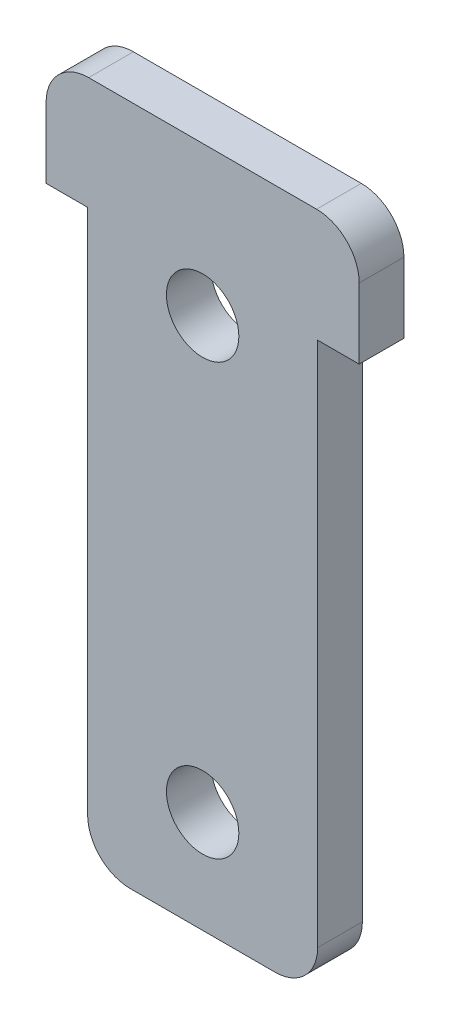
ISO-10303-21;
HEADER;
FILE_DESCRIPTION(('STEP AP214'),'2;1');
FILE_NAME('part.step','',(''),(''),'','','');
FILE_SCHEMA(('AUTOMOTIVE_DESIGN { 1 0 10303 214 1 1 1 1 }'));
ENDSEC;
DATA;
#1=APPLICATION_CONTEXT('core data for automotive mechanical design processes');
#2=APPLICATION_PROTOCOL_DEFINITION('international standard','automotive_design',2000,#1);
#3=PRODUCT_CONTEXT('',#1,'mechanical');
#4=PRODUCT('Part','Part','',(#3));
#5=PRODUCT_RELATED_PRODUCT_CATEGORY('part','',(#4));
#6=PRODUCT_DEFINITION_FORMATION('','',#4);
#7=PRODUCT_DEFINITION_CONTEXT('part definition',#1,'design');
#8=PRODUCT_DEFINITION('design','',#6,#7);
#9=PRODUCT_DEFINITION_SHAPE('','',#8);
#10=(LENGTH_UNIT() NAMED_UNIT(*) SI_UNIT(.MILLI.,.METRE.));
#11=(NAMED_UNIT(*) PLANE_ANGLE_UNIT() SI_UNIT($,.RADIAN.));
#12=(NAMED_UNIT(*) SI_UNIT($,.STERADIAN.) SOLID_ANGLE_UNIT());
#13=UNCERTAINTY_MEASURE_WITH_UNIT(LENGTH_MEASURE(1.E-05),#10,'distance_accuracy_value','');
#14=(GEOMETRIC_REPRESENTATION_CONTEXT(3) GLOBAL_UNCERTAINTY_ASSIGNED_CONTEXT((#13)) GLOBAL_UNIT_ASSIGNED_CONTEXT((#10,
#11,#12)) REPRESENTATION_CONTEXT('',''));
#15=CARTESIAN_POINT('',(0.,0.,0.));
#16=DIRECTION('',(0.,0.,1.));
#17=DIRECTION('',(1.,0.,0.));
#18=AXIS2_PLACEMENT_3D('',#15,#16,#17);
#19=CARTESIAN_POINT('',(10.8,0.,2.1));
#20=DIRECTION('',(-1.,0.,0.));
#21=DIRECTION('',(0.,-1.,0.));
#22=AXIS2_PLACEMENT_3D('',#19,#20,#21);
#23=PLANE('',#22);
#24=DIRECTION('',(0.,1.,0.));
#25=VECTOR('',#24,1.);
#26=CARTESIAN_POINT('',(10.8,0.,0.));
#27=LINE('',#26,#25);
#28=CARTESIAN_POINT('',(10.8,2.00000000000001,0.));
#29=VERTEX_POINT('',#28);
#30=CARTESIAN_POINT('',(10.8,26.7,0.));
#31=VERTEX_POINT('',#30);
#32=EDGE_CURVE('E177',#29,#31,#27,.T.);
#33=ORIENTED_EDGE('',*,*,#32,.T.);
#34=DIRECTION('',(0.,0.,-1.));
#35=VECTOR('',#34,1.);
#36=CARTESIAN_POINT('',(10.8,26.7,2.1));
#37=LINE('',#36,#35);
#38=CARTESIAN_POINT('',(10.8,26.7,2.1));
#39=VERTEX_POINT('',#38);
#40=EDGE_CURVE('E11',#39,#31,#37,.T.);
#41=ORIENTED_EDGE('',*,*,#40,.F.);
#42=DIRECTION('',(0.,1.,0.));
#43=VECTOR('',#42,1.);
#44=CARTESIAN_POINT('',(10.8,0.,2.1));
#45=LINE('',#44,#43);
#46=CARTESIAN_POINT('',(10.8,2.00000000000001,2.1));
#47=VERTEX_POINT('',#46);
#48=EDGE_CURVE('E223',#47,#39,#45,.T.);
#49=ORIENTED_EDGE('',*,*,#48,.F.);
#50=DIRECTION('',(0.,0.,-1.));
#51=VECTOR('',#50,1.);
#52=CARTESIAN_POINT('',(10.8,2.00000000000001,2.1));
#53=LINE('',#52,#51);
#54=EDGE_CURVE('E176',#47,#29,#53,.T.);
#55=ORIENTED_EDGE('',*,*,#54,.T.);
#56=EDGE_LOOP('',(#33,#41,#49,#55));
#57=FACE_BOUND('',#56,.T.);
#58=ADVANCED_FACE('F41',(#57),#23,.F.);
#59=CARTESIAN_POINT('',(0.,26.7,2.1));
#60=DIRECTION('',(0.,1.,0.));
#61=DIRECTION('',(-1.,0.,0.));
#62=AXIS2_PLACEMENT_3D('',#59,#60,#61);
#63=PLANE('',#62);
#64=DIRECTION('',(1.,0.,0.));
#65=VECTOR('',#64,1.);
#66=CARTESIAN_POINT('',(0.,26.7,0.));
#67=LINE('',#66,#65);
#68=CARTESIAN_POINT('',(12.75,26.7,0.));
#69=VERTEX_POINT('',#68);
#70=EDGE_CURVE('E181',#31,#69,#67,.T.);
#71=ORIENTED_EDGE('',*,*,#70,.T.);
#72=DIRECTION('',(0.,0.,-1.));
#73=VECTOR('',#72,1.);
#74=CARTESIAN_POINT('',(12.75,26.7,2.1));
#75=LINE('',#74,#73);
#76=CARTESIAN_POINT('',(12.75,26.7,2.1));
#77=VERTEX_POINT('',#76);
#78=EDGE_CURVE('E50',#77,#69,#75,.T.);
#79=ORIENTED_EDGE('',*,*,#78,.F.);
#80=DIRECTION('',(1.,0.,0.));
#81=VECTOR('',#80,1.);
#82=CARTESIAN_POINT('',(0.,26.7,2.1));
#83=LINE('',#82,#81);
#84=EDGE_CURVE('E112',#39,#77,#83,.T.);
#85=ORIENTED_EDGE('',*,*,#84,.F.);
#86=ORIENTED_EDGE('',*,*,#40,.T.);
#87=EDGE_LOOP('',(#71,#79,#85,#86));
#88=FACE_BOUND('',#87,.T.);
#89=ADVANCED_FACE('F294',(#88),#63,.F.);
#90=CARTESIAN_POINT('',(12.75,0.,2.1));
#91=DIRECTION('',(-1.,0.,0.));
#92=DIRECTION('',(0.,-1.,0.));
#93=AXIS2_PLACEMENT_3D('',#90,#91,#92);
#94=PLANE('',#93);
#95=DIRECTION('',(0.,1.,0.));
#96=VECTOR('',#95,1.);
#97=CARTESIAN_POINT('',(12.75,0.,0.));
#98=LINE('',#97,#96);
#99=CARTESIAN_POINT('',(12.75,30.,0.));
#100=VERTEX_POINT('',#99);
#101=EDGE_CURVE('E184',#69,#100,#98,.T.);
#102=ORIENTED_EDGE('',*,*,#101,.T.);
#103=DIRECTION('',(0.,0.,-1.));
#104=VECTOR('',#103,1.);
#105=CARTESIAN_POINT('',(12.75,30.,2.1));
#106=LINE('',#105,#104);
#107=CARTESIAN_POINT('',(12.75,30.,2.1));
#108=VERTEX_POINT('',#107);
#109=EDGE_CURVE('E245',#108,#100,#106,.T.);
#110=ORIENTED_EDGE('',*,*,#109,.F.);
#111=DIRECTION('',(0.,1.,0.));
#112=VECTOR('',#111,1.);
#113=CARTESIAN_POINT('',(12.75,0.,2.1));
#114=LINE('',#113,#112);
#115=EDGE_CURVE('E254',#77,#108,#114,.T.);
#116=ORIENTED_EDGE('',*,*,#115,.F.);
#117=ORIENTED_EDGE('',*,*,#78,.T.);
#118=EDGE_LOOP('',(#102,#110,#116,#117));
#119=FACE_BOUND('',#118,.T.);
#120=ADVANCED_FACE('F252',(#119),#94,.F.);
#121=CARTESIAN_POINT('',(10.75,30.,2.1));
#122=DIRECTION('',(0.,0.,-1.));
#123=DIRECTION('',(-1.,0.,0.));
#124=AXIS2_PLACEMENT_3D('',#121,#122,#123);
#125=CYLINDRICAL_SURFACE('',#124,2.);
#126=CARTESIAN_POINT('',(10.75,30.,0.));
#127=DIRECTION('',(0.,0.,1.));
#128=DIRECTION('',(1.,0.,0.));
#129=AXIS2_PLACEMENT_3D('',#126,#127,#128);
#130=CIRCLE('',#129,2.);
#131=CARTESIAN_POINT('',(10.75,32.,0.));
#132=VERTEX_POINT('',#131);
#133=EDGE_CURVE('E189',#132,#100,#130,.F.);
#134=ORIENTED_EDGE('',*,*,#133,.F.);
#135=DIRECTION('',(0.,0.,-1.));
#136=VECTOR('',#135,1.);
#137=CARTESIAN_POINT('',(10.75,32.,2.1));
#138=LINE('',#137,#136);
#139=CARTESIAN_POINT('',(10.75,32.,2.1));
#140=VERTEX_POINT('',#139);
#141=EDGE_CURVE('E242',#140,#132,#138,.T.);
#142=ORIENTED_EDGE('',*,*,#141,.F.);
#143=CARTESIAN_POINT('',(10.75,30.,2.1));
#144=DIRECTION('',(0.,0.,1.));
#145=DIRECTION('',(1.,0.,0.));
#146=AXIS2_PLACEMENT_3D('',#143,#144,#145);
#147=CIRCLE('',#146,2.);
#148=EDGE_CURVE('E265',#140,#108,#147,.F.);
#149=ORIENTED_EDGE('',*,*,#148,.T.);
#150=ORIENTED_EDGE('',*,*,#109,.T.);
#151=EDGE_LOOP('',(#134,#142,#149,#150));
#152=FACE_BOUND('',#151,.T.);
#153=ADVANCED_FACE('F262',(#152),#125,.T.);
#154=CARTESIAN_POINT('',(0.,32.,2.1));
#155=DIRECTION('',(0.,1.,0.));
#156=DIRECTION('',(0.,0.,1.));
#157=AXIS2_PLACEMENT_3D('',#154,#155,#156);
#158=PLANE('',#157);
#159=DIRECTION('',(1.,0.,0.));
#160=VECTOR('',#159,1.);
#161=CARTESIAN_POINT('',(0.,32.,0.));
#162=LINE('',#161,#160);
#163=CARTESIAN_POINT('',(0.0500000000000092,32.,0.));
#164=VERTEX_POINT('',#163);
#165=EDGE_CURVE('E193',#164,#132,#162,.T.);
#166=ORIENTED_EDGE('',*,*,#165,.F.);
#167=DIRECTION('',(0.,0.,-1.));
#168=VECTOR('',#167,1.);
#169=CARTESIAN_POINT('',(0.0500000000000092,32.,2.1));
#170=LINE('',#169,#168);
#171=CARTESIAN_POINT('',(0.0500000000000092,32.,2.1));
#172=VERTEX_POINT('',#171);
#173=EDGE_CURVE('E239',#172,#164,#170,.T.);
#174=ORIENTED_EDGE('',*,*,#173,.F.);
#175=DIRECTION('',(1.,0.,0.));
#176=VECTOR('',#175,1.);
#177=CARTESIAN_POINT('',(0.,32.,2.1));
#178=LINE('',#177,#176);
#179=EDGE_CURVE('E269',#172,#140,#178,.T.);
#180=ORIENTED_EDGE('',*,*,#179,.T.);
#181=ORIENTED_EDGE('',*,*,#141,.T.);
#182=EDGE_LOOP('',(#166,#174,#180,#181));
#183=FACE_BOUND('',#182,.T.);
#184=ADVANCED_FACE('F323',(#183),#158,.T.);
#185=CARTESIAN_POINT('',(0.0499999999999945,30.,2.1));
#186=DIRECTION('',(0.,0.,-1.));
#187=DIRECTION('',(-1.,0.,0.));
#188=AXIS2_PLACEMENT_3D('',#185,#186,#187);
#189=CYLINDRICAL_SURFACE('',#188,2.);
#190=CARTESIAN_POINT('',(0.0499999999999945,30.,0.));
#191=DIRECTION('',(0.,0.,1.));
#192=DIRECTION('',(1.,0.,0.));
#193=AXIS2_PLACEMENT_3D('',#190,#191,#192);
#194=CIRCLE('',#193,2.);
#195=CARTESIAN_POINT('',(-1.95000000000001,30.,0.));
#196=VERTEX_POINT('',#195);
#197=EDGE_CURVE('E197',#196,#164,#194,.F.);
#198=ORIENTED_EDGE('',*,*,#197,.F.);
#199=DIRECTION('',(0.,0.,-1.));
#200=VECTOR('',#199,1.);
#201=CARTESIAN_POINT('',(-1.95000000000001,30.,2.1));
#202=LINE('',#201,#200);
#203=CARTESIAN_POINT('',(-1.95000000000001,30.,2.1));
#204=VERTEX_POINT('',#203);
#205=EDGE_CURVE('E236',#204,#196,#202,.T.);
#206=ORIENTED_EDGE('',*,*,#205,.F.);
#207=CARTESIAN_POINT('',(0.0499999999999945,30.,2.1));
#208=DIRECTION('',(0.,0.,1.));
#209=DIRECTION('',(1.,0.,0.));
#210=AXIS2_PLACEMENT_3D('',#207,#208,#209);
#211=CIRCLE('',#210,2.);
#212=EDGE_CURVE('E273',#204,#172,#211,.F.);
#213=ORIENTED_EDGE('',*,*,#212,.T.);
#214=ORIENTED_EDGE('',*,*,#173,.T.);
#215=EDGE_LOOP('',(#198,#206,#213,#214));
#216=FACE_BOUND('',#215,.T.);
#217=ADVANCED_FACE('F313',(#216),#189,.T.);
#218=CARTESIAN_POINT('',(-1.95000000000001,0.,2.1));
#219=DIRECTION('',(-1.,0.,0.));
#220=DIRECTION('',(0.,0.,1.));
#221=AXIS2_PLACEMENT_3D('',#218,#219,#220);
#222=PLANE('',#221);
#223=DIRECTION('',(0.,1.,0.));
#224=VECTOR('',#223,1.);
#225=CARTESIAN_POINT('',(-1.95000000000001,0.,0.));
#226=LINE('',#225,#224);
#227=CARTESIAN_POINT('',(-1.95000000000001,26.7,0.));
#228=VERTEX_POINT('',#227);
#229=EDGE_CURVE('E201',#228,#196,#226,.T.);
#230=ORIENTED_EDGE('',*,*,#229,.F.);
#231=DIRECTION('',(0.,0.,-1.));
#232=VECTOR('',#231,1.);
#233=CARTESIAN_POINT('',(-1.95000000000001,26.7,2.1));
#234=LINE('',#233,#232);
#235=CARTESIAN_POINT('',(-1.95000000000001,26.7,2.1));
#236=VERTEX_POINT('',#235);
#237=EDGE_CURVE('E233',#236,#228,#234,.T.);
#238=ORIENTED_EDGE('',*,*,#237,.F.);
#239=DIRECTION('',(0.,1.,0.));
#240=VECTOR('',#239,1.);
#241=CARTESIAN_POINT('',(-1.95000000000001,0.,2.1));
#242=LINE('',#241,#240);
#243=EDGE_CURVE('E280',#236,#204,#242,.T.);
#244=ORIENTED_EDGE('',*,*,#243,.T.);
#245=ORIENTED_EDGE('',*,*,#205,.T.);
#246=EDGE_LOOP('',(#230,#238,#244,#245));
#247=FACE_BOUND('',#246,.T.);
#248=ADVANCED_FACE('F306',(#247),#222,.T.);
#249=CARTESIAN_POINT('',(0.,26.7,0.));
#250=VERTEX_POINT('',#249);
#251=EDGE_CURVE('E185',#228,#250,#67,.T.);
#252=ORIENTED_EDGE('',*,*,#251,.T.);
#253=DIRECTION('',(0.,0.,-1.));
#254=VECTOR('',#253,1.);
#255=CARTESIAN_POINT('',(0.,26.7,2.1));
#256=LINE('',#255,#254);
#257=CARTESIAN_POINT('',(0.,26.7,2.1));
#258=VERTEX_POINT('',#257);
#259=EDGE_CURVE('E230',#258,#250,#256,.T.);
#260=ORIENTED_EDGE('',*,*,#259,.F.);
#261=EDGE_CURVE('E162',#236,#258,#83,.T.);
#262=ORIENTED_EDGE('',*,*,#261,.F.);
#263=ORIENTED_EDGE('',*,*,#237,.T.);
#264=EDGE_LOOP('',(#252,#260,#262,#263));
#265=FACE_BOUND('',#264,.T.);
#266=ADVANCED_FACE('F297',(#265),#63,.F.);
#267=CARTESIAN_POINT('',(0.,0.,2.1));
#268=DIRECTION('',(-1.,0.,0.));
#269=DIRECTION('',(0.,0.,1.));
#270=AXIS2_PLACEMENT_3D('',#267,#268,#269);
#271=PLANE('',#270);
#272=DIRECTION('',(0.,1.,0.));
#273=VECTOR('',#272,1.);
#274=CARTESIAN_POINT('',(0.,0.,0.));
#275=LINE('',#274,#273);
#276=CARTESIAN_POINT('',(0.,2.00000000000001,0.));
#277=VERTEX_POINT('',#276);
#278=EDGE_CURVE('E205',#277,#250,#275,.T.);
#279=ORIENTED_EDGE('',*,*,#278,.F.);
#280=DIRECTION('',(0.,0.,-1.));
#281=VECTOR('',#280,1.);
#282=CARTESIAN_POINT('',(0.,2.00000000000001,2.1));
#283=LINE('',#282,#281);
#284=CARTESIAN_POINT('',(0.,2.00000000000001,2.1));
#285=VERTEX_POINT('',#284);
#286=EDGE_CURVE('E147',#285,#277,#283,.T.);
#287=ORIENTED_EDGE('',*,*,#286,.F.);
#288=DIRECTION('',(0.,1.,0.));
#289=VECTOR('',#288,1.);
#290=CARTESIAN_POINT('',(0.,0.,2.1));
#291=LINE('',#290,#289);
#292=EDGE_CURVE('E158',#285,#258,#291,.T.);
#293=ORIENTED_EDGE('',*,*,#292,.T.);
#294=ORIENTED_EDGE('',*,*,#259,.T.);
#295=EDGE_LOOP('',(#279,#287,#293,#294));
#296=FACE_BOUND('',#295,.T.);
#297=ADVANCED_FACE('F305',(#296),#271,.T.);
#298=CARTESIAN_POINT('',(2.,2.,2.1));
#299=DIRECTION('',(0.,0.,-1.));
#300=DIRECTION('',(-1.,0.,0.));
#301=AXIS2_PLACEMENT_3D('',#298,#299,#300);
#302=CYLINDRICAL_SURFACE('',#301,2.);
#303=CARTESIAN_POINT('',(2.,2.,0.));
#304=DIRECTION('',(0.,0.,1.));
#305=DIRECTION('',(1.,0.,0.));
#306=AXIS2_PLACEMENT_3D('',#303,#304,#305);
#307=CIRCLE('',#306,2.);
#308=CARTESIAN_POINT('',(2.00000000000001,0.,0.));
#309=VERTEX_POINT('',#308);
#310=EDGE_CURVE('E145',#309,#277,#307,.F.);
#311=ORIENTED_EDGE('',*,*,#310,.F.);
#312=DIRECTION('',(0.,0.,-1.));
#313=VECTOR('',#312,1.);
#314=CARTESIAN_POINT('',(2.00000000000001,0.,2.1));
#315=LINE('',#314,#313);
#316=CARTESIAN_POINT('',(2.00000000000001,0.,2.1));
#317=VERTEX_POINT('',#316);
#318=EDGE_CURVE('E139',#317,#309,#315,.T.);
#319=ORIENTED_EDGE('',*,*,#318,.F.);
#320=CARTESIAN_POINT('',(2.,2.,2.1));
#321=DIRECTION('',(0.,0.,1.));
#322=DIRECTION('',(1.,0.,0.));
#323=AXIS2_PLACEMENT_3D('',#320,#321,#322);
#324=CIRCLE('',#323,2.);
#325=EDGE_CURVE('E143',#317,#285,#324,.F.);
#326=ORIENTED_EDGE('',*,*,#325,.T.);
#327=ORIENTED_EDGE('',*,*,#286,.T.);
#328=EDGE_LOOP('',(#311,#319,#326,#327));
#329=FACE_BOUND('',#328,.T.);
#330=ADVANCED_FACE('F141',(#329),#302,.T.);
#331=CARTESIAN_POINT('',(0.,0.,2.1));
#332=DIRECTION('',(0.,1.,0.));
#333=DIRECTION('',(0.,0.,1.));
#334=AXIS2_PLACEMENT_3D('',#331,#332,#333);
#335=PLANE('',#334);
#336=DIRECTION('',(1.,0.,0.));
#337=VECTOR('',#336,1.);
#338=CARTESIAN_POINT('',(0.,0.,0.));
#339=LINE('',#338,#337);
#340=CARTESIAN_POINT('',(8.79999999999999,0.,0.));
#341=VERTEX_POINT('',#340);
#342=EDGE_CURVE('E98',#309,#341,#339,.T.);
#343=ORIENTED_EDGE('',*,*,#342,.T.);
#344=DIRECTION('',(0.,0.,-1.));
#345=VECTOR('',#344,1.);
#346=CARTESIAN_POINT('',(8.79999999999999,0.,2.1));
#347=LINE('',#346,#345);
#348=CARTESIAN_POINT('',(8.79999999999999,0.,2.1));
#349=VERTEX_POINT('',#348);
#350=EDGE_CURVE('E148',#349,#341,#347,.T.);
#351=ORIENTED_EDGE('',*,*,#350,.F.);
#352=DIRECTION('',(1.,0.,0.));
#353=VECTOR('',#352,1.);
#354=CARTESIAN_POINT('',(0.,0.,2.1));
#355=LINE('',#354,#353);
#356=EDGE_CURVE('E150',#317,#349,#355,.T.);
#357=ORIENTED_EDGE('',*,*,#356,.F.);
#358=ORIENTED_EDGE('',*,*,#318,.T.);
#359=EDGE_LOOP('',(#343,#351,#357,#358));
#360=FACE_BOUND('',#359,.T.);
#361=ADVANCED_FACE('F151',(#360),#335,.F.);
#362=CARTESIAN_POINT('',(5.4,25.,2.1));
#363=DIRECTION('',(0.,0.,-1.));
#364=DIRECTION('',(-1.,0.,0.));
#365=AXIS2_PLACEMENT_3D('',#362,#363,#364);
#366=CYLINDRICAL_SURFACE('',#365,1.7);
#367=CARTESIAN_POINT('',(5.4,25.,2.1));
#368=DIRECTION('',(0.,0.,1.));
#369=DIRECTION('',(1.,0.,0.));
#370=AXIS2_PLACEMENT_3D('',#367,#368,#369);
#371=CIRCLE('',#370,1.7);
#372=CARTESIAN_POINT('',(7.1,25.,2.1));
#373=VERTEX_POINT('',#372);
#374=EDGE_CURVE('E168',#373,#373,#371,.T.);
#375=ORIENTED_EDGE('',*,*,#374,.T.);
#376=EDGE_LOOP('',(#375));
#377=FACE_BOUND('',#376,.T.);
#378=CARTESIAN_POINT('',(5.4,25.,0.));
#379=DIRECTION('',(0.,0.,1.));
#380=DIRECTION('',(1.,0.,0.));
#381=AXIS2_PLACEMENT_3D('',#378,#379,#380);
#382=CIRCLE('',#381,1.7);
#383=CARTESIAN_POINT('',(7.1,25.,0.));
#384=VERTEX_POINT('',#383);
#385=EDGE_CURVE('E215',#384,#384,#382,.T.);
#386=ORIENTED_EDGE('',*,*,#385,.F.);
#387=EDGE_LOOP('',(#386));
#388=FACE_BOUND('',#387,.T.);
#389=ADVANCED_FACE('F396',(#377,#388),#366,.F.);
#390=CARTESIAN_POINT('',(8.8,2.,2.1));
#391=DIRECTION('',(0.,0.,-1.));
#392=DIRECTION('',(-1.,0.,0.));
#393=AXIS2_PLACEMENT_3D('',#390,#391,#392);
#394=CYLINDRICAL_SURFACE('',#393,2.);
#395=CARTESIAN_POINT('',(8.8,2.,0.));
#396=DIRECTION('',(0.,0.,1.));
#397=DIRECTION('',(1.,0.,0.));
#398=AXIS2_PLACEMENT_3D('',#395,#396,#397);
#399=CIRCLE('',#398,2.);
#400=EDGE_CURVE('E104',#341,#29,#399,.T.);
#401=ORIENTED_EDGE('',*,*,#400,.T.);
#402=ORIENTED_EDGE('',*,*,#54,.F.);
#403=CARTESIAN_POINT('',(8.8,2.,2.1));
#404=DIRECTION('',(0.,0.,1.));
#405=DIRECTION('',(1.,0.,0.));
#406=AXIS2_PLACEMENT_3D('',#403,#404,#405);
#407=CIRCLE('',#406,2.);
#408=EDGE_CURVE('E58',#349,#47,#407,.T.);
#409=ORIENTED_EDGE('',*,*,#408,.F.);
#410=ORIENTED_EDGE('',*,*,#350,.T.);
#411=EDGE_LOOP('',(#401,#402,#409,#410));
#412=FACE_BOUND('',#411,.T.);
#413=ADVANCED_FACE('F404',(#412),#394,.T.);
#414=CARTESIAN_POINT('',(5.4,4.8,2.1));
#415=DIRECTION('',(0.,0.,-1.));
#416=DIRECTION('',(-1.,0.,0.));
#417=AXIS2_PLACEMENT_3D('',#414,#415,#416);
#418=CYLINDRICAL_SURFACE('',#417,1.7);
#419=CARTESIAN_POINT('',(5.4,4.8,2.1));
#420=DIRECTION('',(0.,0.,1.));
#421=DIRECTION('',(1.,0.,0.));
#422=AXIS2_PLACEMENT_3D('',#419,#420,#421);
#423=CIRCLE('',#422,1.7);
#424=CARTESIAN_POINT('',(7.1,4.8,2.1));
#425=VERTEX_POINT('',#424);
#426=EDGE_CURVE('E172',#425,#425,#423,.T.);
#427=ORIENTED_EDGE('',*,*,#426,.T.);
#428=EDGE_LOOP('',(#427));
#429=FACE_BOUND('',#428,.T.);
#430=CARTESIAN_POINT('',(5.4,4.8,0.));
#431=DIRECTION('',(0.,0.,1.));
#432=DIRECTION('',(1.,0.,0.));
#433=AXIS2_PLACEMENT_3D('',#430,#431,#432);
#434=CIRCLE('',#433,1.7);
#435=CARTESIAN_POINT('',(7.1,4.8,0.));
#436=VERTEX_POINT('',#435);
#437=EDGE_CURVE('E219',#436,#436,#434,.T.);
#438=ORIENTED_EDGE('',*,*,#437,.F.);
#439=EDGE_LOOP('',(#438));
#440=FACE_BOUND('',#439,.T.);
#441=ADVANCED_FACE('F413',(#429,#440),#418,.F.);
#442=CARTESIAN_POINT('',(0.,0.,2.1));
#443=DIRECTION('',(0.,0.,1.));
#444=DIRECTION('',(1.,0.,0.));
#445=AXIS2_PLACEMENT_3D('',#442,#443,#444);
#446=PLANE('',#445);
#447=ORIENTED_EDGE('',*,*,#48,.T.);
#448=ORIENTED_EDGE('',*,*,#84,.T.);
#449=ORIENTED_EDGE('',*,*,#115,.T.);
#450=ORIENTED_EDGE('',*,*,#148,.F.);
#451=ORIENTED_EDGE('',*,*,#179,.F.);
#452=ORIENTED_EDGE('',*,*,#212,.F.);
#453=ORIENTED_EDGE('',*,*,#243,.F.);
#454=ORIENTED_EDGE('',*,*,#261,.T.);
#455=ORIENTED_EDGE('',*,*,#292,.F.);
#456=ORIENTED_EDGE('',*,*,#325,.F.);
#457=ORIENTED_EDGE('',*,*,#356,.T.);
#458=ORIENTED_EDGE('',*,*,#408,.T.);
#459=EDGE_LOOP('',(#447,#448,#449,#450,#451,#452,#453,#454,#455,#456,#457,#458));
#460=FACE_BOUND('',#459,.T.);
#461=ORIENTED_EDGE('',*,*,#374,.F.);
#462=EDGE_LOOP('',(#461));
#463=FACE_BOUND('',#462,.T.);
#464=ORIENTED_EDGE('',*,*,#426,.F.);
#465=EDGE_LOOP('',(#464));
#466=FACE_BOUND('',#465,.T.);
#467=ADVANCED_FACE('F155',(#460,#463,#466),#446,.T.);
#468=CARTESIAN_POINT('',(0.,0.,0.));
#469=DIRECTION('',(0.,0.,1.));
#470=DIRECTION('',(1.,0.,0.));
#471=AXIS2_PLACEMENT_3D('',#468,#469,#470);
#472=PLANE('',#471);
#473=ORIENTED_EDGE('',*,*,#32,.F.);
#474=ORIENTED_EDGE('',*,*,#400,.F.);
#475=ORIENTED_EDGE('',*,*,#342,.F.);
#476=ORIENTED_EDGE('',*,*,#310,.T.);
#477=ORIENTED_EDGE('',*,*,#278,.T.);
#478=ORIENTED_EDGE('',*,*,#251,.F.);
#479=ORIENTED_EDGE('',*,*,#229,.T.);
#480=ORIENTED_EDGE('',*,*,#197,.T.);
#481=ORIENTED_EDGE('',*,*,#165,.T.);
#482=ORIENTED_EDGE('',*,*,#133,.T.);
#483=ORIENTED_EDGE('',*,*,#101,.F.);
#484=ORIENTED_EDGE('',*,*,#70,.F.);
#485=EDGE_LOOP('',(#473,#474,#475,#476,#477,#478,#479,#480,#481,#482,#483,#484));
#486=FACE_BOUND('',#485,.T.);
#487=ORIENTED_EDGE('',*,*,#385,.T.);
#488=EDGE_LOOP('',(#487));
#489=FACE_BOUND('',#488,.T.);
#490=ORIENTED_EDGE('',*,*,#437,.T.);
#491=EDGE_LOOP('',(#490));
#492=FACE_BOUND('',#491,.T.);
#493=ADVANCED_FACE('F257',(#486,#489,#492),#472,.F.);
#494=CLOSED_SHELL('',(#58,#89,#120,#153,#184,#217,#248,#266,#297,#330,#361,#389,#413,#441,#467,#493));
#495=MANIFOLD_SOLID_BREP('B2',#494);
#496=ADVANCED_BREP_SHAPE_REPRESENTATION('',(#18,#495),#14);
#497=SHAPE_DEFINITION_REPRESENTATION(#9,#496);
ENDSEC;
END-ISO-10303-21;
